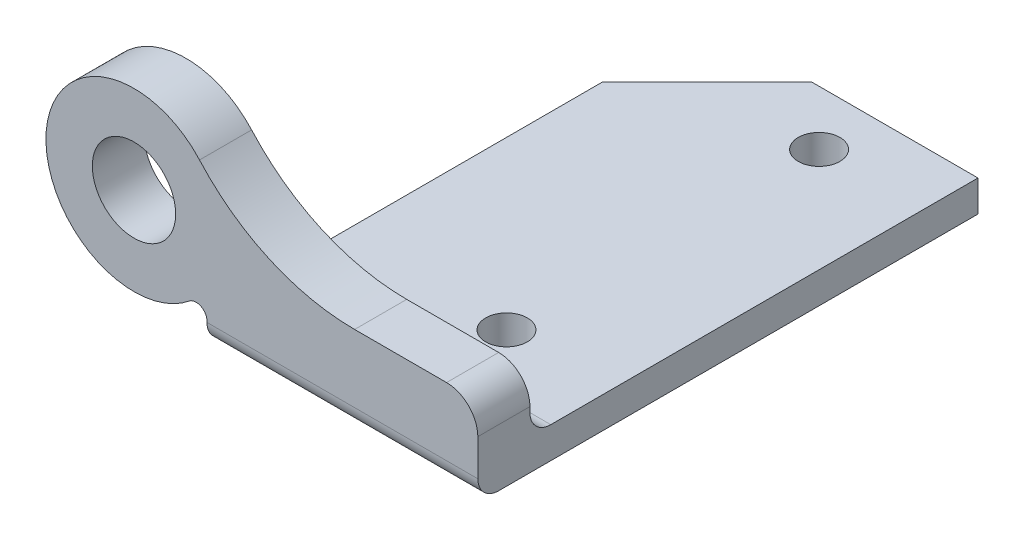
ISO-10303-21;
HEADER;
FILE_DESCRIPTION(('STEP AP214'),'2;1');
FILE_NAME('part.step','',(''),(''),'','','');
FILE_SCHEMA(('AUTOMOTIVE_DESIGN { 1 0 10303 214 1 1 1 1 }'));
ENDSEC;
DATA;
#1=APPLICATION_CONTEXT('core data for automotive mechanical design processes');
#2=APPLICATION_PROTOCOL_DEFINITION('international standard','automotive_design',2000,#1);
#3=PRODUCT_CONTEXT('',#1,'mechanical');
#4=PRODUCT('Part','Part','',(#3));
#5=PRODUCT_RELATED_PRODUCT_CATEGORY('part','',(#4));
#6=PRODUCT_DEFINITION_FORMATION('','',#4);
#7=PRODUCT_DEFINITION_CONTEXT('part definition',#1,'design');
#8=PRODUCT_DEFINITION('design','',#6,#7);
#9=PRODUCT_DEFINITION_SHAPE('','',#8);
#10=(LENGTH_UNIT() NAMED_UNIT(*) SI_UNIT(.MILLI.,.METRE.));
#11=(NAMED_UNIT(*) PLANE_ANGLE_UNIT() SI_UNIT($,.RADIAN.));
#12=(NAMED_UNIT(*) SI_UNIT($,.STERADIAN.) SOLID_ANGLE_UNIT());
#13=UNCERTAINTY_MEASURE_WITH_UNIT(LENGTH_MEASURE(1.E-05),#10,'distance_accuracy_value','');
#14=(GEOMETRIC_REPRESENTATION_CONTEXT(3) GLOBAL_UNCERTAINTY_ASSIGNED_CONTEXT((#13)) GLOBAL_UNIT_ASSIGNED_CONTEXT((#10,
#11,#12)) REPRESENTATION_CONTEXT('',''));
#15=CARTESIAN_POINT('',(0.,0.,0.));
#16=DIRECTION('',(0.,0.,1.));
#17=DIRECTION('',(1.,0.,0.));
#18=AXIS2_PLACEMENT_3D('',#15,#16,#17);
#19=CARTESIAN_POINT('',(8.71716610809906,5.2407015789691,2.));
#20=DIRECTION('',(0.,0.,-1.));
#21=DIRECTION('',(1.,0.,0.));
#22=AXIS2_PLACEMENT_3D('',#19,#20,#21);
#23=CYLINDRICAL_SURFACE('',#22,20.0000000000031);
#24=DIRECTION('',(0.,0.,-1.));
#25=VECTOR('',#24,1.);
#26=CARTESIAN_POINT('',(-6.16896150007952,-8.11606467761962,2.));
#27=LINE('',#26,#25);
#28=CARTESIAN_POINT('',(-6.16896150007952,-8.11606467761962,2.));
#29=VERTEX_POINT('',#28);
#30=CARTESIAN_POINT('',(-6.16896150007952,-8.11606467761962,-3.));
#31=VERTEX_POINT('',#30);
#32=EDGE_CURVE('E201',#29,#31,#27,.T.);
#33=ORIENTED_EDGE('',*,*,#32,.F.);
#34=CARTESIAN_POINT('',(8.71716610809906,5.2407015789691,2.));
#35=DIRECTION('',(0.,0.,1.));
#36=DIRECTION('',(1.,0.,0.));
#37=AXIS2_PLACEMENT_3D('',#34,#35,#36);
#38=CIRCLE('',#37,20.0000000000031);
#39=CARTESIAN_POINT('',(8.71716610809906,-14.759298421034,2.));
#40=VERTEX_POINT('',#39);
#41=EDGE_CURVE('E184',#29,#40,#38,.T.);
#42=ORIENTED_EDGE('',*,*,#41,.T.);
#43=DIRECTION('',(0.,0.,-1.));
#44=VECTOR('',#43,1.);
#45=CARTESIAN_POINT('',(8.71716610809906,-14.759298421034,2.));
#46=LINE('',#45,#44);
#47=CARTESIAN_POINT('',(8.71716610809906,-14.759298421034,-3.));
#48=VERTEX_POINT('',#47);
#49=EDGE_CURVE('E202',#40,#48,#46,.T.);
#50=ORIENTED_EDGE('',*,*,#49,.T.);
#51=CARTESIAN_POINT('',(8.71716610809906,5.2407015789691,-3.));
#52=DIRECTION('',(0.,0.,1.));
#53=DIRECTION('',(1.,0.,0.));
#54=AXIS2_PLACEMENT_3D('',#51,#52,#53);
#55=CIRCLE('',#54,20.0000000000031);
#56=EDGE_CURVE('E163',#31,#48,#55,.T.);
#57=ORIENTED_EDGE('',*,*,#56,.F.);
#58=EDGE_LOOP('',(#33,#42,#50,#57));
#59=FACE_BOUND('',#58,.T.);
#60=ADVANCED_FACE('F43',(#59),#23,.F.);
#61=CARTESIAN_POINT('',(0.,-14.759298421034,2.));
#62=DIRECTION('',(0.,1.,0.));
#63=DIRECTION('',(0.,0.,-1.));
#64=AXIS2_PLACEMENT_3D('',#61,#62,#63);
#65=PLANE('',#64);
#66=ORIENTED_EDGE('',*,*,#49,.F.);
#67=DIRECTION('',(-1.,0.,0.));
#68=VECTOR('',#67,1.);
#69=CARTESIAN_POINT('',(0.,-14.759298421034,2.));
#70=LINE('',#69,#68);
#71=CARTESIAN_POINT('',(17.5416495854691,-14.759298421034,2.));
#72=VERTEX_POINT('',#71);
#73=EDGE_CURVE('E199',#72,#40,#70,.T.);
#74=ORIENTED_EDGE('',*,*,#73,.F.);
#75=DIRECTION('',(0.,0.,-1.));
#76=VECTOR('',#75,1.);
#77=CARTESIAN_POINT('',(17.5416495854691,-14.759298421034,2.));
#78=LINE('',#77,#76);
#79=CARTESIAN_POINT('',(17.5416495854691,-14.759298421034,-3.));
#80=VERTEX_POINT('',#79);
#81=EDGE_CURVE('E206',#72,#80,#78,.T.);
#82=ORIENTED_EDGE('',*,*,#81,.T.);
#83=DIRECTION('',(-1.,0.,0.));
#84=VECTOR('',#83,1.);
#85=CARTESIAN_POINT('',(0.,-14.759298421034,-3.));
#86=LINE('',#85,#84);
#87=EDGE_CURVE('E179',#80,#48,#86,.T.);
#88=ORIENTED_EDGE('',*,*,#87,.T.);
#89=EDGE_LOOP('',(#66,#74,#82,#88));
#90=FACE_BOUND('',#89,.T.);
#91=ADVANCED_FACE('F269',(#90),#65,.T.);
#92=CARTESIAN_POINT('',(17.5416495854691,-17.759298421034,2.));
#93=DIRECTION('',(0.,0.,-1.));
#94=DIRECTION('',(1.,0.,0.));
#95=AXIS2_PLACEMENT_3D('',#92,#93,#94);
#96=CYLINDRICAL_SURFACE('',#95,3.);
#97=ORIENTED_EDGE('',*,*,#81,.F.);
#98=CARTESIAN_POINT('',(17.5416495854691,-17.759298421034,2.));
#99=DIRECTION('',(0.,0.,1.));
#100=DIRECTION('',(1.,0.,0.));
#101=AXIS2_PLACEMENT_3D('',#98,#99,#100);
#102=CIRCLE('',#101,3.);
#103=CARTESIAN_POINT('',(20.5416495854691,-17.759298421034,2.));
#104=VERTEX_POINT('',#103);
#105=EDGE_CURVE('E197',#104,#72,#102,.T.);
#106=ORIENTED_EDGE('',*,*,#105,.F.);
#107=DIRECTION('',(0.,0.,-1.));
#108=VECTOR('',#107,1.);
#109=CARTESIAN_POINT('',(20.5416495854691,-17.759298421034,2.));
#110=LINE('',#109,#108);
#111=CARTESIAN_POINT('',(20.5416495854691,-17.759298421034,-3.));
#112=VERTEX_POINT('',#111);
#113=EDGE_CURVE('E209',#104,#112,#110,.T.);
#114=ORIENTED_EDGE('',*,*,#113,.T.);
#115=CARTESIAN_POINT('',(17.5416495854691,-17.759298421034,-3.));
#116=DIRECTION('',(0.,0.,1.));
#117=DIRECTION('',(1.,0.,0.));
#118=AXIS2_PLACEMENT_3D('',#115,#116,#117);
#119=CIRCLE('',#118,3.);
#120=EDGE_CURVE('E177',#112,#80,#119,.T.);
#121=ORIENTED_EDGE('',*,*,#120,.T.);
#122=EDGE_LOOP('',(#97,#106,#114,#121));
#123=FACE_BOUND('',#122,.T.);
#124=ADVANCED_FACE('F272',(#123),#96,.T.);
#125=CARTESIAN_POINT('',(20.5416495854691,0.,2.));
#126=DIRECTION('',(1.,0.,0.));
#127=DIRECTION('',(0.,0.,1.));
#128=AXIS2_PLACEMENT_3D('',#125,#126,#127);
#129=PLANE('',#128);
#130=DIRECTION('',(0.,0.,-1.));
#131=VECTOR('',#130,1.);
#132=CARTESIAN_POINT('',(20.5416495854682,-23.2592984210307,2.));
#133=LINE('',#132,#131);
#134=CARTESIAN_POINT('',(20.5416495854682,-23.2592984210307,0.));
#135=VERTEX_POINT('',#134);
#136=CARTESIAN_POINT('',(20.5416495854682,-23.2592984210307,-46.0047828549212));
#137=VERTEX_POINT('',#136);
#138=EDGE_CURVE('E159',#135,#137,#133,.T.);
#139=ORIENTED_EDGE('',*,*,#138,.T.);
#140=DIRECTION('',(0.,-1.,0.));
#141=VECTOR('',#140,1.);
#142=CARTESIAN_POINT('',(20.5416495854682,-20.2592984210307,-46.0047828549212));
#143=LINE('',#142,#141);
#144=CARTESIAN_POINT('',(20.5416495854682,-20.2592984210307,-46.0047828549212));
#145=VERTEX_POINT('',#144);
#146=EDGE_CURVE('E142',#145,#137,#143,.T.);
#147=ORIENTED_EDGE('',*,*,#146,.F.);
#148=DIRECTION('',(0.,0.,-1.));
#149=VECTOR('',#148,1.);
#150=CARTESIAN_POINT('',(20.5416495854682,-20.2592984210307,-46.0047828549212));
#151=LINE('',#150,#149);
#152=CARTESIAN_POINT('',(20.5416495854682,-20.2592984210307,-5.));
#153=VERTEX_POINT('',#152);
#154=EDGE_CURVE('E146',#153,#145,#151,.T.);
#155=ORIENTED_EDGE('',*,*,#154,.F.);
#156=CARTESIAN_POINT('',(20.5416495854691,-18.2592984210307,-5.));
#157=DIRECTION('',(-1.,0.,0.));
#158=DIRECTION('',(0.,0.,1.));
#159=AXIS2_PLACEMENT_3D('',#156,#157,#158);
#160=CIRCLE('',#159,2.);
#161=CARTESIAN_POINT('',(20.5416495854691,-18.2592984210307,-3.));
#162=VERTEX_POINT('',#161);
#163=EDGE_CURVE('E11',#162,#153,#160,.F.);
#164=ORIENTED_EDGE('',*,*,#163,.F.);
#165=DIRECTION('',(0.,1.,0.));
#166=VECTOR('',#165,1.);
#167=CARTESIAN_POINT('',(20.5416495854691,0.,-3.));
#168=LINE('',#167,#166);
#169=EDGE_CURVE('E175',#162,#112,#168,.T.);
#170=ORIENTED_EDGE('',*,*,#169,.T.);
#171=ORIENTED_EDGE('',*,*,#113,.F.);
#172=DIRECTION('',(0.,1.,0.));
#173=VECTOR('',#172,1.);
#174=CARTESIAN_POINT('',(20.5416495854691,0.,2.));
#175=LINE('',#174,#173);
#176=CARTESIAN_POINT('',(20.5416495854691,-21.2592984210307,2.));
#177=VERTEX_POINT('',#176);
#178=EDGE_CURVE('E195',#177,#104,#175,.T.);
#179=ORIENTED_EDGE('',*,*,#178,.F.);
#180=CARTESIAN_POINT('',(20.5416495854691,-21.2592984210307,0.));
#181=DIRECTION('',(-1.,0.,0.));
#182=DIRECTION('',(0.,0.,1.));
#183=AXIS2_PLACEMENT_3D('',#180,#181,#182);
#184=CIRCLE('',#183,2.);
#185=EDGE_CURVE('E231',#135,#177,#184,.T.);
#186=ORIENTED_EDGE('',*,*,#185,.F.);
#187=EDGE_LOOP('',(#139,#147,#155,#164,#170,#171,#179,#186));
#188=FACE_BOUND('',#187,.T.);
#189=ADVANCED_FACE('F156',(#188),#129,.T.);
#190=CARTESIAN_POINT('',(0.,-23.2592984210307,2.));
#191=DIRECTION('',(0.,1.,0.));
#192=DIRECTION('',(0.,0.,-1.));
#193=AXIS2_PLACEMENT_3D('',#190,#191,#192);
#194=PLANE('',#193);
#195=DIRECTION('',(-0.999999983085607,0.,0.000183926029933874));
#196=VECTOR('',#195,1.);
#197=CARTESIAN_POINT('',(20.5416495854682,-23.2592984210307,-46.0047828549212));
#198=LINE('',#197,#196);
#199=CARTESIAN_POINT('',(4.5434891841508,-23.2592984210307,-46.0018403767426));
#200=VERTEX_POINT('',#199);
#201=EDGE_CURVE('E166',#137,#200,#198,.T.);
#202=ORIENTED_EDGE('',*,*,#201,.F.);
#203=ORIENTED_EDGE('',*,*,#138,.F.);
#204=DIRECTION('',(-1.,0.,0.));
#205=VECTOR('',#204,1.);
#206=CARTESIAN_POINT('',(0.,-23.2592984210307,0.));
#207=LINE('',#206,#205);
#208=CARTESIAN_POINT('',(-5.45835041453181,-23.2592984210307,0.));
#209=VERTEX_POINT('',#208);
#210=EDGE_CURVE('E229',#209,#135,#207,.F.);
#211=ORIENTED_EDGE('',*,*,#210,.F.);
#212=DIRECTION('',(0.,0.,-1.));
#213=VECTOR('',#212,1.);
#214=CARTESIAN_POINT('',(-5.45835041453181,-23.2592984210307,2.));
#215=LINE('',#214,#213);
#216=CARTESIAN_POINT('',(-5.45835041453181,-23.2592984210307,-36.0000007780627));
#217=VERTEX_POINT('',#216);
#218=EDGE_CURVE('E213',#209,#217,#215,.T.);
#219=ORIENTED_EDGE('',*,*,#218,.T.);
#220=DIRECTION('',(0.707106781186546,0.,-0.707106781186549));
#221=VECTOR('',#220,1.);
#222=CARTESIAN_POINT('',(4.54348918414873,-23.2592984210307,-46.0018403767405));
#223=LINE('',#222,#221);
#224=EDGE_CURVE('E235',#200,#217,#223,.F.);
#225=ORIENTED_EDGE('',*,*,#224,.F.);
#226=EDGE_LOOP('',(#202,#203,#211,#219,#225));
#227=FACE_BOUND('',#226,.T.);
#228=CARTESIAN_POINT('',(10.5416495854728,-23.2592984210307,-10.7504394506908));
#229=DIRECTION('',(0.,1.,0.));
#230=DIRECTION('',(0.,0.,1.));
#231=AXIS2_PLACEMENT_3D('',#228,#229,#230);
#232=CIRCLE('',#231,2.);
#233=CARTESIAN_POINT('',(10.5416495854728,-23.2592984210307,-8.75043945069076));
#234=VERTEX_POINT('',#233);
#235=EDGE_CURVE('E297',#234,#234,#232,.T.);
#236=ORIENTED_EDGE('',*,*,#235,.T.);
#237=EDGE_LOOP('',(#236));
#238=FACE_BOUND('',#237,.T.);
#239=CARTESIAN_POINT('',(10.5416495854727,-23.2592984210307,-40.7504394506913));
#240=DIRECTION('',(0.,1.,0.));
#241=DIRECTION('',(0.,0.,1.));
#242=AXIS2_PLACEMENT_3D('',#239,#240,#241);
#243=CIRCLE('',#242,2.);
#244=CARTESIAN_POINT('',(10.5416495854727,-23.2592984210307,-38.7504394506913));
#245=VERTEX_POINT('',#244);
#246=EDGE_CURVE('E289',#245,#245,#243,.T.);
#247=ORIENTED_EDGE('',*,*,#246,.T.);
#248=EDGE_LOOP('',(#247));
#249=FACE_BOUND('',#248,.T.);
#250=ADVANCED_FACE('F283',(#227,#238,#249),#194,.F.);
#251=CARTESIAN_POINT('',(-5.45835041456107,-7.51245318596319E-12,2.));
#252=DIRECTION('',(-1.,-1.37632299420031E-12,0.));
#253=DIRECTION('',(1.37632299420031E-12,-1.,0.));
#254=AXIS2_PLACEMENT_3D('',#251,#252,#253);
#255=PLANE('',#254);
#256=ORIENTED_EDGE('',*,*,#218,.F.);
#257=CARTESIAN_POINT('',(-5.45835041453181,-21.2592984210307,0.));
#258=DIRECTION('',(1.,1.37632299420031E-12,0.));
#259=DIRECTION('',(1.37632299420031E-12,-1.,0.));
#260=AXIS2_PLACEMENT_3D('',#257,#258,#259);
#261=CIRCLE('',#260,2.);
#262=CARTESIAN_POINT('',(-5.45835041453181,-21.2592984210307,2.));
#263=VERTEX_POINT('',#262);
#264=EDGE_CURVE('E227',#263,#209,#261,.T.);
#265=ORIENTED_EDGE('',*,*,#264,.F.);
#266=DIRECTION('',(1.37632299420031E-12,-1.,0.));
#267=VECTOR('',#266,1.);
#268=CARTESIAN_POINT('',(-5.45835041456107,-7.51245318596319E-12,2.));
#269=LINE('',#268,#267);
#270=CARTESIAN_POINT('',(-5.45835041453209,-21.0601545352137,2.));
#271=VERTEX_POINT('',#270);
#272=EDGE_CURVE('E192',#271,#263,#269,.T.);
#273=ORIENTED_EDGE('',*,*,#272,.F.);
#274=DIRECTION('',(0.,0.,-1.));
#275=VECTOR('',#274,1.);
#276=CARTESIAN_POINT('',(-5.45835041453209,-21.0601545352137,2.));
#277=LINE('',#276,#275);
#278=CARTESIAN_POINT('',(-5.45835041453181,-21.0601545352171,-3.));
#279=VERTEX_POINT('',#278);
#280=EDGE_CURVE('E216',#271,#279,#277,.T.);
#281=ORIENTED_EDGE('',*,*,#280,.T.);
#282=DIRECTION('',(0.,-1.,0.));
#283=VECTOR('',#282,1.);
#284=CARTESIAN_POINT('',(-5.45835041453181,0.,-3.));
#285=LINE('',#284,#283);
#286=CARTESIAN_POINT('',(-5.45835041453181,-18.2592984210307,-3.));
#287=VERTEX_POINT('',#286);
#288=EDGE_CURVE('E205',#287,#279,#285,.T.);
#289=ORIENTED_EDGE('',*,*,#288,.F.);
#290=CARTESIAN_POINT('',(-5.45835041453594,-18.2592984210307,-5.));
#291=DIRECTION('',(1.,1.37632299420031E-12,0.));
#292=DIRECTION('',(1.37632299420031E-12,-1.,0.));
#293=AXIS2_PLACEMENT_3D('',#290,#291,#292);
#294=CIRCLE('',#293,2.);
#295=CARTESIAN_POINT('',(-5.45835041453181,-20.2592984210307,-5.));
#296=VERTEX_POINT('',#295);
#297=EDGE_CURVE('E51',#296,#287,#294,.F.);
#298=ORIENTED_EDGE('',*,*,#297,.F.);
#299=DIRECTION('',(0.,0.,1.));
#300=VECTOR('',#299,1.);
#301=CARTESIAN_POINT('',(-5.45835041453182,-20.2592984210307,-46.0000007780621));
#302=LINE('',#301,#300);
#303=CARTESIAN_POINT('',(-5.45835041453182,-20.2592984210307,-36.0000007780627));
#304=VERTEX_POINT('',#303);
#305=EDGE_CURVE('E154',#304,#296,#302,.T.);
#306=ORIENTED_EDGE('',*,*,#305,.F.);
#307=DIRECTION('',(-1.37632299420031E-12,1.,0.));
#308=VECTOR('',#307,1.);
#309=CARTESIAN_POINT('',(-5.45835041456107,-7.50283380388278E-12,-36.0000007780627));
#310=LINE('',#309,#308);
#311=EDGE_CURVE('E238',#217,#304,#310,.T.);
#312=ORIENTED_EDGE('',*,*,#311,.F.);
#313=EDGE_LOOP('',(#256,#265,#273,#281,#289,#298,#306,#312));
#314=FACE_BOUND('',#313,.T.);
#315=ADVANCED_FACE('F249',(#314),#255,.T.);
#316=CARTESIAN_POINT('',(-6.49822931459182,-21.1445458718312,2.));
#317=DIRECTION('',(0.,0.,-1.));
#318=DIRECTION('',(1.,0.,0.));
#319=AXIS2_PLACEMENT_3D('',#316,#317,#318);
#320=CYLINDRICAL_SURFACE('',#319,1.0432976682067);
#321=ORIENTED_EDGE('',*,*,#280,.F.);
#322=CARTESIAN_POINT('',(-6.49822931459182,-21.1445458718312,2.));
#323=DIRECTION('',(0.,0.,1.));
#324=DIRECTION('',(1.,0.,0.));
#325=AXIS2_PLACEMENT_3D('',#322,#323,#324);
#326=CIRCLE('',#325,1.0432976682067);
#327=CARTESIAN_POINT('',(-7.09327104945139,-20.2875771686332,2.));
#328=VERTEX_POINT('',#327);
#329=EDGE_CURVE('E189',#271,#328,#326,.T.);
#330=ORIENTED_EDGE('',*,*,#329,.T.);
#331=DIRECTION('',(0.,0.,-1.));
#332=VECTOR('',#331,1.);
#333=CARTESIAN_POINT('',(-7.09327104945139,-20.2875771686332,2.));
#334=LINE('',#333,#332);
#335=CARTESIAN_POINT('',(-7.09327104945139,-20.2875771686332,-3.));
#336=VERTEX_POINT('',#335);
#337=EDGE_CURVE('E219',#328,#336,#334,.T.);
#338=ORIENTED_EDGE('',*,*,#337,.T.);
#339=CARTESIAN_POINT('',(-6.49822931459182,-21.1445458718312,-3.));
#340=DIRECTION('',(0.,0.,1.));
#341=DIRECTION('',(1.,0.,0.));
#342=AXIS2_PLACEMENT_3D('',#339,#340,#341);
#343=CIRCLE('',#342,1.0432976682067);
#344=EDGE_CURVE('E172',#279,#336,#343,.T.);
#345=ORIENTED_EDGE('',*,*,#344,.F.);
#346=EDGE_LOOP('',(#321,#330,#338,#345));
#347=FACE_BOUND('',#346,.T.);
#348=ADVANCED_FACE('F257',(#347),#320,.F.);
#349=CARTESIAN_POINT('',(-12.4583504145318,-13.7592984210307,2.));
#350=DIRECTION('',(0.,0.,-1.));
#351=DIRECTION('',(1.,0.,0.));
#352=AXIS2_PLACEMENT_3D('',#349,#350,#351);
#353=CYLINDRICAL_SURFACE('',#352,4.);
#354=CARTESIAN_POINT('',(-12.4583504145318,-13.7592984210307,2.));
#355=DIRECTION('',(0.,0.,1.));
#356=DIRECTION('',(1.,0.,0.));
#357=AXIS2_PLACEMENT_3D('',#354,#355,#356);
#358=CIRCLE('',#357,4.);
#359=CARTESIAN_POINT('',(-8.45835041453181,-13.7592984210307,2.));
#360=VERTEX_POINT('',#359);
#361=EDGE_CURVE('E181',#360,#360,#358,.T.);
#362=ORIENTED_EDGE('',*,*,#361,.T.);
#363=EDGE_LOOP('',(#362));
#364=FACE_BOUND('',#363,.T.);
#365=CARTESIAN_POINT('',(-12.4583504145318,-13.7592984210307,-3.));
#366=DIRECTION('',(0.,0.,1.));
#367=DIRECTION('',(1.,0.,0.));
#368=AXIS2_PLACEMENT_3D('',#365,#366,#367);
#369=CIRCLE('',#368,4.);
#370=CARTESIAN_POINT('',(-8.45835041453181,-13.7592984210307,-3.));
#371=VERTEX_POINT('',#370);
#372=EDGE_CURVE('E160',#371,#371,#369,.T.);
#373=ORIENTED_EDGE('',*,*,#372,.F.);
#374=EDGE_LOOP('',(#373));
#375=FACE_BOUND('',#374,.T.);
#376=ADVANCED_FACE('F325',(#364,#375),#353,.F.);
#377=CARTESIAN_POINT('',(-12.4583504145309,-13.7592984210308,2.));
#378=DIRECTION('',(0.,0.,-1.));
#379=DIRECTION('',(1.,0.,0.));
#380=AXIS2_PLACEMENT_3D('',#377,#378,#379);
#381=CYLINDRICAL_SURFACE('',#380,8.44999999999993);
#382=ORIENTED_EDGE('',*,*,#337,.F.);
#383=CARTESIAN_POINT('',(-12.4583504145309,-13.7592984210308,2.));
#384=DIRECTION('',(0.,0.,1.));
#385=DIRECTION('',(1.,0.,0.));
#386=AXIS2_PLACEMENT_3D('',#383,#384,#385);
#387=CIRCLE('',#386,8.44999999999993);
#388=EDGE_CURVE('E187',#29,#328,#387,.T.);
#389=ORIENTED_EDGE('',*,*,#388,.F.);
#390=ORIENTED_EDGE('',*,*,#32,.T.);
#391=CARTESIAN_POINT('',(-12.4583504145309,-13.7592984210308,-3.));
#392=DIRECTION('',(0.,0.,1.));
#393=DIRECTION('',(1.,0.,0.));
#394=AXIS2_PLACEMENT_3D('',#391,#392,#393);
#395=CIRCLE('',#394,8.44999999999993);
#396=EDGE_CURVE('E170',#31,#336,#395,.T.);
#397=ORIENTED_EDGE('',*,*,#396,.T.);
#398=EDGE_LOOP('',(#382,#389,#390,#397));
#399=FACE_BOUND('',#398,.T.);
#400=ADVANCED_FACE('F259',(#399),#381,.T.);
#401=CARTESIAN_POINT('',(0.,0.,2.));
#402=DIRECTION('',(0.,0.,-1.));
#403=DIRECTION('',(1.,0.,0.));
#404=AXIS2_PLACEMENT_3D('',#401,#402,#403);
#405=PLANE('',#404);
#406=ORIENTED_EDGE('',*,*,#178,.T.);
#407=ORIENTED_EDGE('',*,*,#105,.T.);
#408=ORIENTED_EDGE('',*,*,#73,.T.);
#409=ORIENTED_EDGE('',*,*,#41,.F.);
#410=ORIENTED_EDGE('',*,*,#388,.T.);
#411=ORIENTED_EDGE('',*,*,#329,.F.);
#412=ORIENTED_EDGE('',*,*,#272,.T.);
#413=DIRECTION('',(-1.,0.,0.));
#414=VECTOR('',#413,1.);
#415=CARTESIAN_POINT('',(0.,-21.2592984210307,2.));
#416=LINE('',#415,#414);
#417=EDGE_CURVE('E225',#177,#263,#416,.T.);
#418=ORIENTED_EDGE('',*,*,#417,.F.);
#419=EDGE_LOOP('',(#406,#407,#408,#409,#410,#411,#412,#418));
#420=FACE_BOUND('',#419,.T.);
#421=ORIENTED_EDGE('',*,*,#361,.F.);
#422=EDGE_LOOP('',(#421));
#423=FACE_BOUND('',#422,.T.);
#424=ADVANCED_FACE('F276',(#420,#423),#405,.F.);
#425=CARTESIAN_POINT('',(0.,0.,-3.));
#426=DIRECTION('',(0.,0.,-1.));
#427=DIRECTION('',(1.,0.,0.));
#428=AXIS2_PLACEMENT_3D('',#425,#426,#427);
#429=PLANE('',#428);
#430=ORIENTED_EDGE('',*,*,#288,.T.);
#431=ORIENTED_EDGE('',*,*,#344,.T.);
#432=ORIENTED_EDGE('',*,*,#396,.F.);
#433=ORIENTED_EDGE('',*,*,#56,.T.);
#434=ORIENTED_EDGE('',*,*,#87,.F.);
#435=ORIENTED_EDGE('',*,*,#120,.F.);
#436=ORIENTED_EDGE('',*,*,#169,.F.);
#437=DIRECTION('',(-1.,0.,0.));
#438=VECTOR('',#437,1.);
#439=CARTESIAN_POINT('',(20.5416495854682,-18.2592984210307,-3.));
#440=LINE('',#439,#438);
#441=EDGE_CURVE('E58',#287,#162,#440,.F.);
#442=ORIENTED_EDGE('',*,*,#441,.F.);
#443=EDGE_LOOP('',(#430,#431,#432,#433,#434,#435,#436,#442));
#444=FACE_BOUND('',#443,.T.);
#445=ORIENTED_EDGE('',*,*,#372,.T.);
#446=EDGE_LOOP('',(#445));
#447=FACE_BOUND('',#446,.T.);
#448=ADVANCED_FACE('F252',(#444,#447),#429,.T.);
#449=CARTESIAN_POINT('',(20.5416495854682,-20.2592984210307,-46.0047828549212));
#450=DIRECTION('',(-0.000183926029933874,0.,-0.999999983085608));
#451=DIRECTION('',(0.999999983085608,0.,-0.000183926029933874));
#452=AXIS2_PLACEMENT_3D('',#449,#450,#451);
#453=PLANE('',#452);
#454=DIRECTION('',(-0.999999983085607,0.,0.000183926029933874));
#455=VECTOR('',#454,1.);
#456=CARTESIAN_POINT('',(20.5416495854682,-20.2592984210307,-46.0047828549212));
#457=LINE('',#456,#455);
#458=CARTESIAN_POINT('',(4.54348918414667,-20.2592984210307,-46.0018403767426));
#459=VERTEX_POINT('',#458);
#460=EDGE_CURVE('E137',#145,#459,#457,.T.);
#461=ORIENTED_EDGE('',*,*,#460,.F.);
#462=ORIENTED_EDGE('',*,*,#146,.T.);
#463=ORIENTED_EDGE('',*,*,#201,.T.);
#464=DIRECTION('',(1.37632299420031E-12,-1.,0.));
#465=VECTOR('',#464,1.);
#466=CARTESIAN_POINT('',(4.54348918414666,-20.2592984210527,-46.0018403767426));
#467=LINE('',#466,#465);
#468=EDGE_CURVE('E144',#459,#200,#467,.T.);
#469=ORIENTED_EDGE('',*,*,#468,.F.);
#470=EDGE_LOOP('',(#461,#462,#463,#469));
#471=FACE_BOUND('',#470,.T.);
#472=ADVANCED_FACE('F139',(#471),#453,.T.);
#473=CARTESIAN_POINT('',(0.,-20.2592984210307,0.));
#474=DIRECTION('',(0.,1.,0.));
#475=DIRECTION('',(0.,0.,-1.));
#476=AXIS2_PLACEMENT_3D('',#473,#474,#475);
#477=PLANE('',#476);
#478=CARTESIAN_POINT('',(10.5416495854728,-20.2592984210307,-10.7504394506908));
#479=DIRECTION('',(0.,1.,0.));
#480=DIRECTION('',(0.,0.,1.));
#481=AXIS2_PLACEMENT_3D('',#478,#479,#480);
#482=CIRCLE('',#481,2.);
#483=CARTESIAN_POINT('',(10.5416495854728,-20.2592984210307,-8.75043945069076));
#484=VERTEX_POINT('',#483);
#485=EDGE_CURVE('E294',#484,#484,#482,.T.);
#486=ORIENTED_EDGE('',*,*,#485,.F.);
#487=EDGE_LOOP('',(#486));
#488=FACE_BOUND('',#487,.T.);
#489=CARTESIAN_POINT('',(10.5416495854727,-20.2592984210307,-40.7504394506913));
#490=DIRECTION('',(0.,1.,0.));
#491=DIRECTION('',(0.,0.,1.));
#492=AXIS2_PLACEMENT_3D('',#489,#490,#491);
#493=CIRCLE('',#492,2.);
#494=CARTESIAN_POINT('',(10.5416495854727,-20.2592984210307,-38.7504394506913));
#495=VERTEX_POINT('',#494);
#496=EDGE_CURVE('E286',#495,#495,#493,.T.);
#497=ORIENTED_EDGE('',*,*,#496,.F.);
#498=EDGE_LOOP('',(#497));
#499=FACE_BOUND('',#498,.T.);
#500=ORIENTED_EDGE('',*,*,#154,.T.);
#501=ORIENTED_EDGE('',*,*,#460,.T.);
#502=DIRECTION('',(-0.707106781186546,0.,0.707106781186549));
#503=VECTOR('',#502,1.);
#504=CARTESIAN_POINT('',(-20.729175596298,-20.2592984210307,-20.7291755962979));
#505=LINE('',#504,#503);
#506=EDGE_CURVE('E241',#304,#459,#505,.F.);
#507=ORIENTED_EDGE('',*,*,#506,.F.);
#508=ORIENTED_EDGE('',*,*,#305,.T.);
#509=DIRECTION('',(-1.,0.,0.));
#510=VECTOR('',#509,1.);
#511=CARTESIAN_POINT('',(-5.45835041453181,-20.2592984210307,-5.));
#512=LINE('',#511,#510);
#513=EDGE_CURVE('E151',#153,#296,#512,.T.);
#514=ORIENTED_EDGE('',*,*,#513,.F.);
#515=EDGE_LOOP('',(#500,#501,#507,#508,#514));
#516=FACE_BOUND('',#515,.T.);
#517=ADVANCED_FACE('F149',(#488,#499,#516),#477,.T.);
#518=CARTESIAN_POINT('',(10.5416495854727,-20.2592984210307,-40.7504394506913));
#519=DIRECTION('',(0.,-1.,0.));
#520=DIRECTION('',(0.,0.,1.));
#521=AXIS2_PLACEMENT_3D('',#518,#519,#520);
#522=CYLINDRICAL_SURFACE('',#521,2.);
#523=ORIENTED_EDGE('',*,*,#496,.T.);
#524=EDGE_LOOP('',(#523));
#525=FACE_BOUND('',#524,.T.);
#526=ORIENTED_EDGE('',*,*,#246,.F.);
#527=EDGE_LOOP('',(#526));
#528=FACE_BOUND('',#527,.T.);
#529=ADVANCED_FACE('F308',(#525,#528),#522,.F.);
#530=CARTESIAN_POINT('',(10.5416495854728,-20.2592984210307,-10.7504394506908));
#531=DIRECTION('',(0.,-1.,0.));
#532=DIRECTION('',(0.,0.,1.));
#533=AXIS2_PLACEMENT_3D('',#530,#531,#532);
#534=CYLINDRICAL_SURFACE('',#533,2.);
#535=ORIENTED_EDGE('',*,*,#485,.T.);
#536=EDGE_LOOP('',(#535));
#537=FACE_BOUND('',#536,.T.);
#538=ORIENTED_EDGE('',*,*,#235,.F.);
#539=EDGE_LOOP('',(#538));
#540=FACE_BOUND('',#539,.T.);
#541=ADVANCED_FACE('F303',(#537,#540),#534,.F.);
#542=CARTESIAN_POINT('',(0.,-21.2592984210307,0.));
#543=DIRECTION('',(-1.,0.,0.));
#544=DIRECTION('',(0.,0.,-1.));
#545=AXIS2_PLACEMENT_3D('',#542,#543,#544);
#546=CYLINDRICAL_SURFACE('',#545,2.);
#547=ORIENTED_EDGE('',*,*,#185,.T.);
#548=ORIENTED_EDGE('',*,*,#417,.T.);
#549=ORIENTED_EDGE('',*,*,#264,.T.);
#550=ORIENTED_EDGE('',*,*,#210,.T.);
#551=EDGE_LOOP('',(#547,#548,#549,#550));
#552=FACE_BOUND('',#551,.T.);
#553=ADVANCED_FACE('F280',(#552),#546,.T.);
#554=CARTESIAN_POINT('',(4.54348918414666,-20.2592984210527,-46.0018403767426));
#555=DIRECTION('',(0.707106781186549,9.73028324139892E-13,0.707106781186546));
#556=DIRECTION('',(1.37632299420031E-12,-1.,0.));
#557=AXIS2_PLACEMENT_3D('',#554,#555,#556);
#558=PLANE('',#557);
#559=ORIENTED_EDGE('',*,*,#506,.T.);
#560=ORIENTED_EDGE('',*,*,#468,.T.);
#561=ORIENTED_EDGE('',*,*,#224,.T.);
#562=ORIENTED_EDGE('',*,*,#311,.T.);
#563=EDGE_LOOP('',(#559,#560,#561,#562));
#564=FACE_BOUND('',#563,.T.);
#565=ADVANCED_FACE('F330',(#564),#558,.F.);
#566=CARTESIAN_POINT('',(0.,-18.2592984210307,-5.));
#567=DIRECTION('',(1.,0.,0.));
#568=DIRECTION('',(0.,0.,1.));
#569=AXIS2_PLACEMENT_3D('',#566,#567,#568);
#570=CYLINDRICAL_SURFACE('',#569,2.);
#571=ORIENTED_EDGE('',*,*,#163,.T.);
#572=ORIENTED_EDGE('',*,*,#513,.T.);
#573=ORIENTED_EDGE('',*,*,#297,.T.);
#574=ORIENTED_EDGE('',*,*,#441,.T.);
#575=EDGE_LOOP('',(#571,#572,#573,#574));
#576=FACE_BOUND('',#575,.T.);
#577=ADVANCED_FACE('F45',(#576),#570,.F.);
#578=CLOSED_SHELL('',(#60,#91,#124,#189,#250,#315,#348,#376,#400,#424,#448,#472,#517,#529,#541,
#553,#565,#577));
#579=MANIFOLD_SOLID_BREP('B2',#578);
#580=ADVANCED_BREP_SHAPE_REPRESENTATION('',(#18,#579),#14);
#581=SHAPE_DEFINITION_REPRESENTATION(#9,#580);
ENDSEC;
END-ISO-10303-21;
